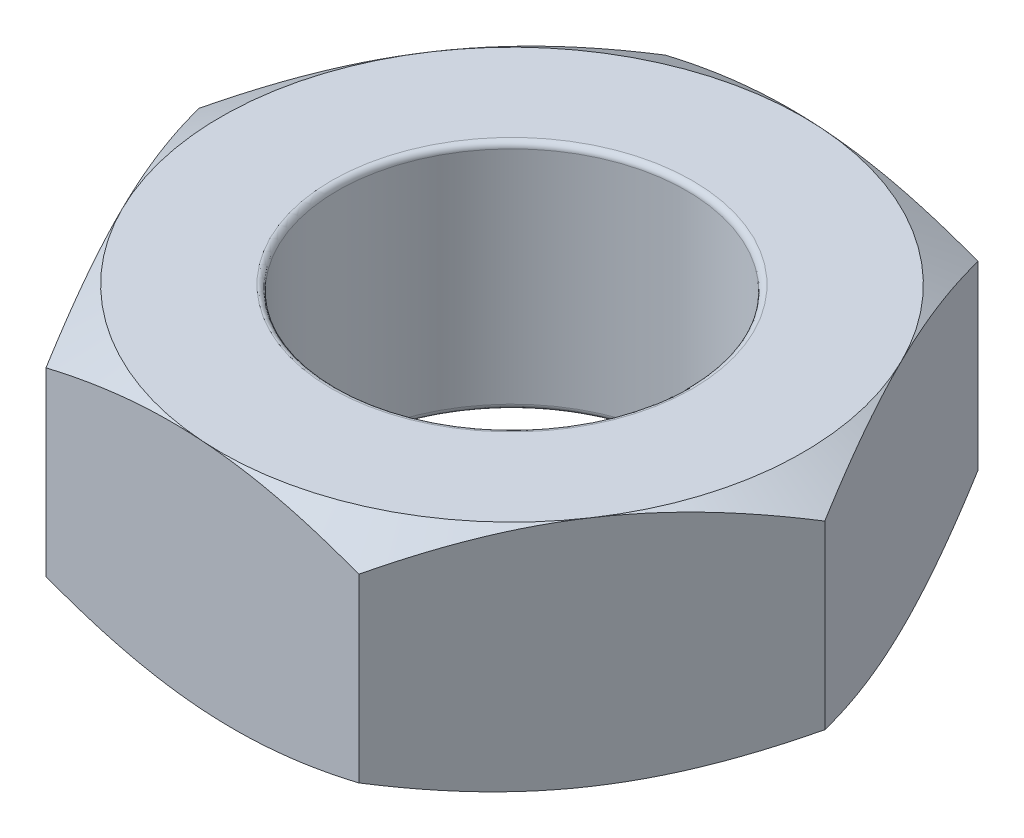
ISO-10303-21;
HEADER;
FILE_DESCRIPTION(('STEP AP214'),'2;1');
FILE_NAME('part.step','',(''),(''),'','','');
FILE_SCHEMA(('AUTOMOTIVE_DESIGN { 1 0 10303 214 1 1 1 1 }'));
ENDSEC;
DATA;
#1=APPLICATION_CONTEXT('core data for automotive mechanical design processes');
#2=APPLICATION_PROTOCOL_DEFINITION('international standard','automotive_design',2000,#1);
#3=PRODUCT_CONTEXT('',#1,'mechanical');
#4=PRODUCT('Part','Part','',(#3));
#5=PRODUCT_RELATED_PRODUCT_CATEGORY('part','',(#4));
#6=PRODUCT_DEFINITION_FORMATION('','',#4);
#7=PRODUCT_DEFINITION_CONTEXT('part definition',#1,'design');
#8=PRODUCT_DEFINITION('design','',#6,#7);
#9=PRODUCT_DEFINITION_SHAPE('','',#8);
#10=(LENGTH_UNIT() NAMED_UNIT(*) SI_UNIT(.MILLI.,.METRE.));
#11=(NAMED_UNIT(*) PLANE_ANGLE_UNIT() SI_UNIT($,.RADIAN.));
#12=(NAMED_UNIT(*) SI_UNIT($,.STERADIAN.) SOLID_ANGLE_UNIT());
#13=UNCERTAINTY_MEASURE_WITH_UNIT(LENGTH_MEASURE(1.E-05),#10,'distance_accuracy_value','');
#14=(GEOMETRIC_REPRESENTATION_CONTEXT(3) GLOBAL_UNCERTAINTY_ASSIGNED_CONTEXT((#13)) GLOBAL_UNIT_ASSIGNED_CONTEXT((#10,
#11,#12)) REPRESENTATION_CONTEXT('',''));
#15=CARTESIAN_POINT('',(0.,0.,0.));
#16=DIRECTION('',(0.,0.,1.));
#17=DIRECTION('',(1.,0.,0.));
#18=AXIS2_PLACEMENT_3D('',#15,#16,#17);
#19=CARTESIAN_POINT('',(-1.27361431394222,2.,-2.59060608982817));
#20=DIRECTION('',(0.830790431180641,0.,0.556585356848961));
#21=DIRECTION('',(0.556585356848961,0.,-0.830790431180641));
#22=AXIS2_PLACEMENT_3D('',#19,#20,#21);
#23=PLANE('',#22);
#24=CARTESIAN_POINT('',(-2.8804718313128,0.223360492131222,-0.192120694416632));
#25=CARTESIAN_POINT('',(-2.80986380166012,0.186724215651782,-0.297514188295199));
#26=CARTESIAN_POINT('',(-2.73864628949333,0.153404567842738,-0.403817429860216));
#27=CARTESIAN_POINT('',(-2.59497799726085,0.0952441224797167,-0.618264757627765));
#28=CARTESIAN_POINT('',(-2.5225246639532,0.0704239011021496,-0.726412654942053));
#29=CARTESIAN_POINT('',(-2.3785159430858,0.0317866995737146,-0.941368125528867));
#30=CARTESIAN_POINT('',(-2.30698271611449,0.0177125838658962,-1.04814262066774));
#31=CARTESIAN_POINT('',(-2.16357958453336,0.000909436624432206,-1.26219415481773));
#32=CARTESIAN_POINT('',(-2.09171020133633,-0.0018335076939088,-1.36947041553896));
#33=CARTESIAN_POINT('',(-1.95741230832504,0.00386541673552177,-1.56993096138077));
#34=CARTESIAN_POINT('',(-1.89496371922326,0.0109080040113135,-1.66314521796885));
#35=CARTESIAN_POINT('',(-1.77047340324417,0.033231156164161,-1.84896642583464));
#36=CARTESIAN_POINT('',(-1.70843210712207,0.0485193504936714,-1.94157273414302));
#37=CARTESIAN_POINT('',(-1.58368500749084,0.0867395522640062,-2.12777723164884));
#38=CARTESIAN_POINT('',(-1.52099499691787,0.109833612928976,-2.22135184742655));
#39=CARTESIAN_POINT('',(-1.3965501128978,0.162248393929256,-2.40710524100947));
#40=CARTESIAN_POINT('',(-1.33479364448095,0.191556794425373,-2.49928639955574));
#41=CARTESIAN_POINT('',(-1.2734803245904,0.223360492131222,-2.59080608982817));
#42=B_SPLINE_CURVE_WITH_KNOTS('',3,(#24,#25,#26,#27,#28,#29,#30,#31,#32,#33,#34,#35,#36,#37,#38,
#39,#40,#41),.UNSPECIFIED.,.F.,.F.,(4,2,2,2,2,2,2,2,4),(0.,0.396286498049262,0.793525689892849,
1.18093283486657,1.56786416697508,1.90480431794579,2.24205676733797,2.58679114709091,
2.93084838126731),.UNSPECIFIED.);
#43=CARTESIAN_POINT('',(-2.88033784196098,0.223290993692602,-0.192320694416631));
#44=VERTEX_POINT('',#43);
#45=CARTESIAN_POINT('',(-2.0769760779516,0.,-1.3914633921224));
#46=VERTEX_POINT('',#45);
#47=EDGE_CURVE('E71',#44,#46,#42,.T.);
#48=ORIENTED_EDGE('',*,*,#47,.F.);
#49=DIRECTION('',(0.,-1.,0.));
#50=VECTOR('',#49,1.);
#51=CARTESIAN_POINT('',(-2.88033784196098,2.,-0.192320694416632));
#52=LINE('',#51,#50);
#53=CARTESIAN_POINT('',(-2.88033784196098,1.7767090063074,-0.192320694416632));
#54=VERTEX_POINT('',#53);
#55=EDGE_CURVE('E305',#54,#44,#52,.T.);
#56=ORIENTED_EDGE('',*,*,#55,.F.);
#57=CARTESIAN_POINT('',(-1.2734803245904,1.77663950786878,-2.59080608982817));
#58=CARTESIAN_POINT('',(-1.34408835424308,1.81327578434822,-2.48541259594961));
#59=CARTESIAN_POINT('',(-1.41530586640988,1.84659543215726,-2.37910935438459));
#60=CARTESIAN_POINT('',(-1.55897415864236,1.90475587752028,-2.16466202661704));
#61=CARTESIAN_POINT('',(-1.63142749195001,1.92957609889785,-2.05651412930275));
#62=CARTESIAN_POINT('',(-1.77543621281741,1.96821330042629,-1.84155865871594));
#63=CARTESIAN_POINT('',(-1.84696943978871,1.9822874161341,-1.73478416357707));
#64=CARTESIAN_POINT('',(-1.99037257136985,1.99909056337557,-1.52073262942707));
#65=CARTESIAN_POINT('',(-2.06224195456687,2.00183350769391,-1.41345636870585));
#66=CARTESIAN_POINT('',(-2.19653984757816,1.99613458326448,-1.21299582286404));
#67=CARTESIAN_POINT('',(-2.25898843667994,1.98909199598869,-1.11978156627595));
#68=CARTESIAN_POINT('',(-2.38347875265903,1.96676884383584,-0.933960358410169));
#69=CARTESIAN_POINT('',(-2.44552004878113,1.95148064950633,-0.841354050101789));
#70=CARTESIAN_POINT('',(-2.57026714841236,1.91326044773599,-0.655149552595963));
#71=CARTESIAN_POINT('',(-2.63295715898533,1.89016638707102,-0.56157493681826));
#72=CARTESIAN_POINT('',(-2.7574020430054,1.83775160607074,-0.375821543235331));
#73=CARTESIAN_POINT('',(-2.81915851142225,1.80844320557463,-0.28364038468906));
#74=CARTESIAN_POINT('',(-2.8804718313128,1.77663950786878,-0.192120694416631));
#75=B_SPLINE_CURVE_WITH_KNOTS('',3,(#57,#58,#59,#60,#61,#62,#63,#64,#65,#66,#67,#68,#69,#70,#71,
#72,#73,#74),.UNSPECIFIED.,.F.,.F.,(4,2,2,2,2,2,2,2,4),(0.,0.396286498049262,0.79352568989285,
1.18093283486657,1.56786416697508,1.90480431794579,2.24205676733797,2.58679114709091,
2.93084838126731),.UNSPECIFIED.);
#76=CARTESIAN_POINT('',(-2.0769760779516,2.,-1.3914633921224));
#77=VERTEX_POINT('',#76);
#78=EDGE_CURVE('E285',#77,#54,#75,.T.);
#79=ORIENTED_EDGE('',*,*,#78,.F.);
#80=CARTESIAN_POINT('',(-1.27361431394222,1.7767090063074,-2.59060608982817));
#81=VERTEX_POINT('',#80);
#82=EDGE_CURVE('E291',#81,#77,#75,.T.);
#83=ORIENTED_EDGE('',*,*,#82,.F.);
#84=DIRECTION('',(0.,-1.,0.));
#85=VECTOR('',#84,1.);
#86=CARTESIAN_POINT('',(-1.27361431394222,2.,-2.59060608982817));
#87=LINE('',#86,#85);
#88=CARTESIAN_POINT('',(-1.27361431394222,0.223290993692602,-2.59060608982817));
#89=VERTEX_POINT('',#88);
#90=EDGE_CURVE('E293',#81,#89,#87,.T.);
#91=ORIENTED_EDGE('',*,*,#90,.T.);
#92=EDGE_CURVE('E186',#46,#89,#42,.T.);
#93=ORIENTED_EDGE('',*,*,#92,.F.);
#94=EDGE_LOOP('',(#48,#56,#79,#83,#91,#93));
#95=FACE_BOUND('',#94,.T.);
#96=ADVANCED_FACE('F48',(#95),#23,.F.);
#97=CARTESIAN_POINT('',(-2.88033784196098,2.,-0.192320694416632));
#98=DIRECTION('',(0.897412273995948,0.,-0.441192940198982));
#99=DIRECTION('',(-0.441192940198982,0.,-0.897412273995948));
#100=AXIS2_PLACEMENT_3D('',#97,#98,#99);
#101=PLANE('',#100);
#102=CARTESIAN_POINT('',(-1.60662520243241,0.223355332426769,2.39848539541154));
#103=CARTESIAN_POINT('',(-1.66259449762223,0.186719479683932,2.28464057176682));
#104=CARTESIAN_POINT('',(-1.71904691530838,0.153400281956862,2.1698130486758));
#105=CARTESIAN_POINT('',(-1.83292932178774,0.0952407707380594,1.93816956562123));
#106=CARTESIAN_POINT('',(-1.89036133439422,0.0704210328353752,1.82134948910301));
#107=CARTESIAN_POINT('',(-2.00451358363305,0.0317847871021549,1.5891571300753));
#108=CARTESIAN_POINT('',(-2.06121625464183,0.0177111466306705,1.47382057707271));
#109=CARTESIAN_POINT('',(-2.17488845729822,0.000908917936975301,1.24260466090236));
#110=CARTESIAN_POINT('',(-2.23185757566622,-0.00183358268119343,1.12672613836953));
#111=CARTESIAN_POINT('',(-2.33831122165894,0.00386604309677712,0.910193189128776));
#112=CARTESIAN_POINT('',(-2.38781166979709,0.0109087163075833,0.809506379164312));
#113=CARTESIAN_POINT('',(-2.48649006475729,0.0332316359780781,0.608788745796097));
#114=CARTESIAN_POINT('',(-2.53566767016656,0.0485195109662276,0.508758616845936));
#115=CARTESIAN_POINT('',(-2.63454958810946,0.0867387158063652,0.307627005813809));
#116=CARTESIAN_POINT('',(-2.68424138296334,0.109832086051889,0.20655098542543));
#117=CARTESIAN_POINT('',(-2.78288375062307,0.162245223864608,0.00590663369592742));
#118=CARTESIAN_POINT('',(-2.83183558758333,0.19155267289636,-0.0936642690093186));
#119=CARTESIAN_POINT('',(-2.88043616754733,0.223355332426769,-0.192520694416632));
#120=B_SPLINE_CURVE_WITH_KNOTS('',3,(#102,#103,#104,#105,#106,#107,#108,#109,#110,#111,#112,
#113,#114,#115,#116,#117,#118,#119),.UNSPECIFIED.,.F.,.F.,(4,2,2,2,2,2,2,2,4),(0.,
0.396285274277618,0.793523208836641,1.1809292469671,1.56785948558832,1.90479172780143,
2.24203623860918,2.58676225962568,2.93081119436377),.UNSPECIFIED.);
#121=CARTESIAN_POINT('',(-1.60672352801876,0.223290993692602,2.39828539541154));
#122=VERTEX_POINT('',#121);
#123=CARTESIAN_POINT('',(-2.24353068498987,0.,1.10298235049745));
#124=VERTEX_POINT('',#123);
#125=EDGE_CURVE('E176',#122,#124,#120,.T.);
#126=ORIENTED_EDGE('',*,*,#125,.F.);
#127=DIRECTION('',(0.,-1.,0.));
#128=VECTOR('',#127,1.);
#129=CARTESIAN_POINT('',(-1.60672352801876,2.,2.39828539541154));
#130=LINE('',#129,#128);
#131=CARTESIAN_POINT('',(-1.60672352801876,1.7767090063074,2.39828539541154));
#132=VERTEX_POINT('',#131);
#133=EDGE_CURVE('E302',#132,#122,#130,.T.);
#134=ORIENTED_EDGE('',*,*,#133,.F.);
#135=CARTESIAN_POINT('',(-2.88043616754733,1.77664466757323,-0.192520694416632));
#136=CARTESIAN_POINT('',(-2.82446687235751,1.81328052031607,-0.0786758707719152));
#137=CARTESIAN_POINT('',(-2.76801445467136,1.84659971804314,0.0361516523191128));
#138=CARTESIAN_POINT('',(-2.654132048192,1.90475922926194,0.267795135373675));
#139=CARTESIAN_POINT('',(-2.59670003558552,1.92957896716462,0.384615211891894));
#140=CARTESIAN_POINT('',(-2.48254778634668,1.96821521289784,0.616807570919613));
#141=CARTESIAN_POINT('',(-2.42584511533791,1.98228885336933,0.732144123922201));
#142=CARTESIAN_POINT('',(-2.31217291268152,1.99909108206302,0.963360040092551));
#143=CARTESIAN_POINT('',(-2.25520379431352,2.00183358268119,1.07923856262538));
#144=CARTESIAN_POINT('',(-2.1487501483208,1.99613395690322,1.29577151186613));
#145=CARTESIAN_POINT('',(-2.09924970018265,1.98909128369242,1.3964583218306));
#146=CARTESIAN_POINT('',(-2.00057130522245,1.96676836402192,1.59717595519881));
#147=CARTESIAN_POINT('',(-1.95139369981318,1.95148048903377,1.69720608414897));
#148=CARTESIAN_POINT('',(-1.85251178187028,1.91326128419364,1.8983376951811));
#149=CARTESIAN_POINT('',(-1.8028199870164,1.89016791394811,1.99941371556948));
#150=CARTESIAN_POINT('',(-1.70417761935667,1.83775477613539,2.20005806729898));
#151=CARTESIAN_POINT('',(-1.65522578239641,1.80844732710364,2.29962897000423));
#152=CARTESIAN_POINT('',(-1.60662520243241,1.77664466757323,2.39848539541154));
#153=B_SPLINE_CURVE_WITH_KNOTS('',3,(#135,#136,#137,#138,#139,#140,#141,#142,#143,#144,#145,
#146,#147,#148,#149,#150,#151,#152),.UNSPECIFIED.,.F.,.F.,(4,2,2,2,2,2,2,2,4),(0.,
0.396285274277618,0.793523208836641,1.1809292469671,1.56785948558832,1.90479172780143,
2.24203623860918,2.58676225962568,2.93081119436377),.UNSPECIFIED.);
#154=CARTESIAN_POINT('',(-2.24353068498987,2.,1.10298235049745));
#155=VERTEX_POINT('',#154);
#156=EDGE_CURVE('E264',#155,#132,#153,.T.);
#157=ORIENTED_EDGE('',*,*,#156,.F.);
#158=EDGE_CURVE('E292',#54,#155,#153,.T.);
#159=ORIENTED_EDGE('',*,*,#158,.F.);
#160=ORIENTED_EDGE('',*,*,#55,.T.);
#161=EDGE_CURVE('E150',#124,#44,#120,.T.);
#162=ORIENTED_EDGE('',*,*,#161,.F.);
#163=EDGE_LOOP('',(#126,#134,#157,#159,#160,#162));
#164=FACE_BOUND('',#163,.T.);
#165=ADVANCED_FACE('F273',(#164),#101,.F.);
#166=CARTESIAN_POINT('',(-1.60672352801876,2.,2.39828539541154));
#167=DIRECTION('',(0.0666218428153073,0.,-0.997778297047943));
#168=DIRECTION('',(-0.997778297047943,0.,-0.0666218428153073));
#169=AXIS2_PLACEMENT_3D('',#166,#167,#168);
#170=PLANE('',#169);
#171=CARTESIAN_POINT('',(1.27381431394222,0.223348860288484,2.59061944386544));
#172=CARTESIAN_POINT('',(1.14723753449179,0.186713539071293,2.5821678887158));
#173=CARTESIAN_POINT('',(1.0195681535317,0.153394905917019,2.57364338035977));
#174=CARTESIAN_POINT('',(0.762018606557151,0.0952365664672077,2.55644674911768));
#175=CARTESIAN_POINT('',(0.63213386383723,0.0704174350239425,2.54777432064415));
#176=CARTESIAN_POINT('',(0.373974076261845,0.0317823882166104,2.53053694352343));
#177=CARTESIAN_POINT('',(0.24573875521575,0.017709343869416,2.52197464724241));
#178=CARTESIAN_POINT('',(-0.0113353583428609,0.000908267376840826,2.50480976077809));
#179=CARTESIAN_POINT('',(-0.140173216297431,-0.00183367667688157,2.49620723299541));
#180=CARTESIAN_POINT('',(-0.380919293570337,0.00386682882951836,2.48013257255638));
#181=CARTESIAN_POINT('',(-0.492863529514754,0.010909609818012,2.4726580350632));
#182=CARTESIAN_POINT('',(-0.716022676381481,0.0332322378484759,2.45775765724446));
#183=CARTESIAN_POINT('',(-0.827236815288971,0.0485197122599824,2.45033186846648));
#184=CARTESIAN_POINT('',(-1.05085617143185,0.086737666581051,2.43540076238861));
#185=CARTESIAN_POINT('',(-1.16323308228277,0.10983017079073,2.4278973351113));
#186=CARTESIAN_POINT('',(-1.38631071092521,0.162241247453206,2.41300240027959));
#187=CARTESIAN_POINT('',(-1.49701428725516,0.191547503005819,2.40561070186004));
#188=CARTESIAN_POINT('',(-1.60692352801876,0.223348860288483,2.39827204137427));
#189=B_SPLINE_CURVE_WITH_KNOTS('',3,(#171,#172,#173,#174,#175,#176,#177,#178,#179,#180,#181,
#182,#183,#184,#185,#186,#187,#188),.UNSPECIFIED.,.F.,.F.,(4,2,2,2,2,2,2,2,4),(0.,
0.396283739223727,0.793520096691492,1.18092474643986,1.56785361343206,1.90477593507899,
2.24201048790883,2.58672602393769,2.93076454806571),.UNSPECIFIED.);
#190=CARTESIAN_POINT('',(1.27361431394222,0.223290993692602,2.59060608982817));
#191=VERTEX_POINT('',#190);
#192=CARTESIAN_POINT('',(-0.166554607038268,0.,2.49444574261986));
#193=VERTEX_POINT('',#192);
#194=EDGE_CURVE('E159',#191,#193,#189,.T.);
#195=ORIENTED_EDGE('',*,*,#194,.F.);
#196=DIRECTION('',(0.,-1.,0.));
#197=VECTOR('',#196,1.);
#198=CARTESIAN_POINT('',(1.27361431394222,2.,2.59060608982817));
#199=LINE('',#198,#197);
#200=CARTESIAN_POINT('',(1.27361431394222,1.7767090063074,2.59060608982817));
#201=VERTEX_POINT('',#200);
#202=EDGE_CURVE('E174',#201,#191,#199,.T.);
#203=ORIENTED_EDGE('',*,*,#202,.F.);
#204=CARTESIAN_POINT('',(-1.60692352801876,1.77665113971152,2.39827204137427));
#205=CARTESIAN_POINT('',(-1.48034674856832,1.81328646092871,2.40672359652391));
#206=CARTESIAN_POINT('',(-1.35267736760824,1.84660509408298,2.41524810487994));
#207=CARTESIAN_POINT('',(-1.09512782063369,1.90476343353279,2.43244473612203));
#208=CARTESIAN_POINT('',(-0.965243077913766,1.92958256497606,2.44111716459557));
#209=CARTESIAN_POINT('',(-0.707083290338381,1.96821761178339,2.45835454171628));
#210=CARTESIAN_POINT('',(-0.578847969292286,1.98229065613058,2.46691683799731));
#211=CARTESIAN_POINT('',(-0.321773855733675,1.99909173262316,2.48408172446162));
#212=CARTESIAN_POINT('',(-0.192935997779105,2.00183367667688,2.49268425224431));
#213=CARTESIAN_POINT('',(0.0478100794938011,1.99613317117048,2.50875891268333));
#214=CARTESIAN_POINT('',(0.159754315438218,1.98909039018199,2.51623345017652));
#215=CARTESIAN_POINT('',(0.382913462304945,1.96676776215152,2.53113382799526));
#216=CARTESIAN_POINT('',(0.494127601212436,1.95148028774002,2.53855961677324));
#217=CARTESIAN_POINT('',(0.717746957355318,1.91326233341895,2.5534907228511));
#218=CARTESIAN_POINT('',(0.830123868206239,1.89016982920927,2.56099415012841));
#219=CARTESIAN_POINT('',(1.05320149684867,1.83775875254679,2.57588908496013));
#220=CARTESIAN_POINT('',(1.16390507317863,1.80845249699418,2.58328078337967));
#221=CARTESIAN_POINT('',(1.27381431394222,1.77665113971152,2.59061944386544));
#222=B_SPLINE_CURVE_WITH_KNOTS('',3,(#204,#205,#206,#207,#208,#209,#210,#211,#212,#213,#214,
#215,#216,#217,#218,#219,#220,#221),.UNSPECIFIED.,.F.,.F.,(4,2,2,2,2,2,2,2,4),(0.,
0.396283739223727,0.793520096691491,1.18092474643986,1.56785361343206,1.90477593507899,
2.24201048790883,2.58672602393769,2.93076454806571),.UNSPECIFIED.);
#223=CARTESIAN_POINT('',(-0.166554607038268,2.,2.49444574261986));
#224=VERTEX_POINT('',#223);
#225=EDGE_CURVE('E257',#224,#201,#222,.T.);
#226=ORIENTED_EDGE('',*,*,#225,.F.);
#227=EDGE_CURVE('E263',#132,#224,#222,.T.);
#228=ORIENTED_EDGE('',*,*,#227,.F.);
#229=ORIENTED_EDGE('',*,*,#133,.T.);
#230=EDGE_CURVE('E175',#193,#122,#189,.T.);
#231=ORIENTED_EDGE('',*,*,#230,.F.);
#232=EDGE_LOOP('',(#195,#203,#226,#228,#229,#231));
#233=FACE_BOUND('',#232,.T.);
#234=ADVANCED_FACE('F270',(#233),#170,.F.);
#235=CARTESIAN_POINT('',(1.27361431394222,2.,2.59060608982817));
#236=DIRECTION('',(-0.830790431180641,0.,-0.556585356848961));
#237=DIRECTION('',(-0.556585356848961,0.,0.830790431180641));
#238=AXIS2_PLACEMENT_3D('',#235,#236,#237);
#239=PLANE('',#238);
#240=CARTESIAN_POINT('',(2.8804718313128,0.223360492131222,0.192120694416632));
#241=CARTESIAN_POINT('',(2.80986380166012,0.186724215651782,0.2975141882952));
#242=CARTESIAN_POINT('',(2.73864628949333,0.153404567842739,0.403817429860216));
#243=CARTESIAN_POINT('',(2.59497799726085,0.0952441224797171,0.618264757627765));
#244=CARTESIAN_POINT('',(2.5225246639532,0.0704239011021498,0.726412654942053));
#245=CARTESIAN_POINT('',(2.3785159430858,0.0317866995737149,0.941368125528867));
#246=CARTESIAN_POINT('',(2.30698271611449,0.0177125838658965,1.04814262066774));
#247=CARTESIAN_POINT('',(2.16357958453336,0.000909436624432542,1.26219415481773));
#248=CARTESIAN_POINT('',(2.09171020133633,-0.00183350769390847,1.36947041553896));
#249=CARTESIAN_POINT('',(1.95741230832504,0.00386541673552218,1.56993096138077));
#250=CARTESIAN_POINT('',(1.89496371922326,0.010908004011314,1.66314521796885));
#251=CARTESIAN_POINT('',(1.77047340324417,0.0332311561641616,1.84896642583464));
#252=CARTESIAN_POINT('',(1.70843210712207,0.0485193504936719,1.94157273414302));
#253=CARTESIAN_POINT('',(1.58368500749085,0.0867395522640067,2.12777723164884));
#254=CARTESIAN_POINT('',(1.52099499691787,0.109833612928976,2.22135184742655));
#255=CARTESIAN_POINT('',(1.3965501128978,0.162248393929256,2.40710524100948));
#256=CARTESIAN_POINT('',(1.33479364448096,0.191556794425373,2.49928639955575));
#257=CARTESIAN_POINT('',(1.27348032459041,0.223360492131222,2.59080608982817));
#258=B_SPLINE_CURVE_WITH_KNOTS('',3,(#240,#241,#242,#243,#244,#245,#246,#247,#248,#249,#250,
#251,#252,#253,#254,#255,#256,#257),.UNSPECIFIED.,.F.,.F.,(4,2,2,2,2,2,2,2,4),(0.,
0.396286498049262,0.793525689892849,1.18093283486657,1.56786416697508,1.90480431794579,
2.24205676733797,2.58679114709091,2.93084838126731),.UNSPECIFIED.);
#259=CARTESIAN_POINT('',(2.88033784196098,0.223290993692602,0.192320694416632));
#260=VERTEX_POINT('',#259);
#261=CARTESIAN_POINT('',(2.0769760779516,0.,1.3914633921224));
#262=VERTEX_POINT('',#261);
#263=EDGE_CURVE('E138',#260,#262,#258,.T.);
#264=ORIENTED_EDGE('',*,*,#263,.F.);
#265=DIRECTION('',(0.,-1.,0.));
#266=VECTOR('',#265,1.);
#267=CARTESIAN_POINT('',(2.88033784196098,2.,0.192320694416632));
#268=LINE('',#267,#266);
#269=CARTESIAN_POINT('',(2.88033784196098,1.7767090063074,0.192320694416632));
#270=VERTEX_POINT('',#269);
#271=EDGE_CURVE('E299',#270,#260,#268,.T.);
#272=ORIENTED_EDGE('',*,*,#271,.F.);
#273=CARTESIAN_POINT('',(1.27348032459041,1.77663950786878,2.59080608982817));
#274=CARTESIAN_POINT('',(1.34408835424308,1.81327578434822,2.48541259594961));
#275=CARTESIAN_POINT('',(1.41530586640988,1.84659543215726,2.37910935438459));
#276=CARTESIAN_POINT('',(1.55897415864236,1.90475587752028,2.16466202661704));
#277=CARTESIAN_POINT('',(1.63142749195001,1.92957609889785,2.05651412930275));
#278=CARTESIAN_POINT('',(1.77543621281741,1.96821330042629,1.84155865871594));
#279=CARTESIAN_POINT('',(1.84696943978872,1.9822874161341,1.73478416357707));
#280=CARTESIAN_POINT('',(1.99037257136985,1.99909056337557,1.52073262942707));
#281=CARTESIAN_POINT('',(2.06224195456687,2.00183350769391,1.41345636870585));
#282=CARTESIAN_POINT('',(2.19653984757816,1.99613458326448,1.21299582286404));
#283=CARTESIAN_POINT('',(2.25898843667994,1.98909199598869,1.11978156627595));
#284=CARTESIAN_POINT('',(2.38347875265903,1.96676884383584,0.933960358410169));
#285=CARTESIAN_POINT('',(2.44552004878113,1.95148064950633,0.841354050101789));
#286=CARTESIAN_POINT('',(2.57026714841236,1.91326044773599,0.655149552595963));
#287=CARTESIAN_POINT('',(2.63295715898533,1.89016638707102,0.561574936818261));
#288=CARTESIAN_POINT('',(2.7574020430054,1.83775160607074,0.375821543235332));
#289=CARTESIAN_POINT('',(2.81915851142225,1.80844320557463,0.283640384689061));
#290=CARTESIAN_POINT('',(2.8804718313128,1.77663950786878,0.192120694416632));
#291=B_SPLINE_CURVE_WITH_KNOTS('',3,(#273,#274,#275,#276,#277,#278,#279,#280,#281,#282,#283,
#284,#285,#286,#287,#288,#289,#290),.UNSPECIFIED.,.F.,.F.,(4,2,2,2,2,2,2,2,4),(0.,
0.396286498049262,0.79352568989285,1.18093283486657,1.56786416697508,1.90480431794579,
2.24205676733797,2.58679114709091,2.9308483812673),.UNSPECIFIED.);
#292=CARTESIAN_POINT('',(2.0769760779516,2.,1.3914633921224));
#293=VERTEX_POINT('',#292);
#294=EDGE_CURVE('E250',#293,#270,#291,.T.);
#295=ORIENTED_EDGE('',*,*,#294,.F.);
#296=EDGE_CURVE('E256',#201,#293,#291,.T.);
#297=ORIENTED_EDGE('',*,*,#296,.F.);
#298=ORIENTED_EDGE('',*,*,#202,.T.);
#299=EDGE_CURVE('E152',#262,#191,#258,.T.);
#300=ORIENTED_EDGE('',*,*,#299,.F.);
#301=EDGE_LOOP('',(#264,#272,#295,#297,#298,#300));
#302=FACE_BOUND('',#301,.T.);
#303=ADVANCED_FACE('F171',(#302),#239,.F.);
#304=CARTESIAN_POINT('',(2.88033784196098,2.,0.192320694416632));
#305=DIRECTION('',(-0.897412273995948,0.,0.441192940198982));
#306=DIRECTION('',(0.441192940198982,0.,0.897412273995948));
#307=AXIS2_PLACEMENT_3D('',#304,#305,#306);
#308=PLANE('',#307);
#309=CARTESIAN_POINT('',(1.60662520243241,0.223355332426769,-2.39848539541154));
#310=CARTESIAN_POINT('',(1.66259449762223,0.186719479683932,-2.28464057176682));
#311=CARTESIAN_POINT('',(1.71904691530838,0.153400281956863,-2.1698130486758));
#312=CARTESIAN_POINT('',(1.83292932178774,0.0952407707380595,-1.93816956562123));
#313=CARTESIAN_POINT('',(1.89036133439422,0.0704210328353753,-1.82134948910301));
#314=CARTESIAN_POINT('',(2.00451358363306,0.0317847871021549,-1.5891571300753));
#315=CARTESIAN_POINT('',(2.06121625464183,0.0177111466306706,-1.47382057707271));
#316=CARTESIAN_POINT('',(2.17488845729822,0.00090891793697549,-1.24260466090236));
#317=CARTESIAN_POINT('',(2.23185757566622,-0.0018335826811931,-1.12672613836953));
#318=CARTESIAN_POINT('',(2.33831122165894,0.00386604309677754,-0.910193189128775));
#319=CARTESIAN_POINT('',(2.38781166979709,0.0109087163075837,-0.809506379164312));
#320=CARTESIAN_POINT('',(2.48649006475729,0.0332316359780785,-0.608788745796096));
#321=CARTESIAN_POINT('',(2.53566767016656,0.048519510966228,-0.508758616845935));
#322=CARTESIAN_POINT('',(2.63454958810946,0.0867387158063656,-0.307627005813809));
#323=CARTESIAN_POINT('',(2.68424138296334,0.109832086051889,-0.206550985425429));
#324=CARTESIAN_POINT('',(2.78288375062307,0.162245223864609,-0.00590663369592686));
#325=CARTESIAN_POINT('',(2.83183558758333,0.191552672896361,0.093664269009319));
#326=CARTESIAN_POINT('',(2.88043616754733,0.223355332426769,0.192520694416632));
#327=B_SPLINE_CURVE_WITH_KNOTS('',3,(#309,#310,#311,#312,#313,#314,#315,#316,#317,#318,#319,
#320,#321,#322,#323,#324,#325,#326),.UNSPECIFIED.,.F.,.F.,(4,2,2,2,2,2,2,2,4),(0.,
0.396285274277619,0.793523208836642,1.1809292469671,1.56785948558832,1.90479172780143,
2.24203623860918,2.58676225962568,2.93081119436377),.UNSPECIFIED.);
#328=CARTESIAN_POINT('',(1.60672352801876,0.223290993692602,-2.39828539541154));
#329=VERTEX_POINT('',#328);
#330=CARTESIAN_POINT('',(2.24353068498987,0.,-1.10298235049745));
#331=VERTEX_POINT('',#330);
#332=EDGE_CURVE('E63',#329,#331,#327,.T.);
#333=ORIENTED_EDGE('',*,*,#332,.F.);
#334=DIRECTION('',(0.,-1.,0.));
#335=VECTOR('',#334,1.);
#336=CARTESIAN_POINT('',(1.60672352801876,2.,-2.39828539541154));
#337=LINE('',#336,#335);
#338=CARTESIAN_POINT('',(1.60672352801876,1.7767090063074,-2.39828539541154));
#339=VERTEX_POINT('',#338);
#340=EDGE_CURVE('E296',#339,#329,#337,.T.);
#341=ORIENTED_EDGE('',*,*,#340,.F.);
#342=CARTESIAN_POINT('',(2.88043616754733,1.77664466757323,0.192520694416632));
#343=CARTESIAN_POINT('',(2.82446687235751,1.81328052031607,0.0786758707719153));
#344=CARTESIAN_POINT('',(2.76801445467136,1.84659971804314,-0.0361516523191126));
#345=CARTESIAN_POINT('',(2.654132048192,1.90475922926194,-0.267795135373675));
#346=CARTESIAN_POINT('',(2.59670003558552,1.92957896716462,-0.384615211891894));
#347=CARTESIAN_POINT('',(2.48254778634669,1.96821521289784,-0.616807570919613));
#348=CARTESIAN_POINT('',(2.42584511533791,1.98228885336933,-0.732144123922201));
#349=CARTESIAN_POINT('',(2.31217291268152,1.99909108206302,-0.963360040092552));
#350=CARTESIAN_POINT('',(2.25520379431352,2.00183358268119,-1.07923856262538));
#351=CARTESIAN_POINT('',(2.1487501483208,1.99613395690322,-1.29577151186613));
#352=CARTESIAN_POINT('',(2.09924970018265,1.98909128369242,-1.3964583218306));
#353=CARTESIAN_POINT('',(2.00057130522245,1.96676836402192,-1.59717595519881));
#354=CARTESIAN_POINT('',(1.95139369981318,1.95148048903377,-1.69720608414897));
#355=CARTESIAN_POINT('',(1.85251178187028,1.91326128419363,-1.8983376951811));
#356=CARTESIAN_POINT('',(1.8028199870164,1.89016791394811,-1.99941371556948));
#357=CARTESIAN_POINT('',(1.70417761935668,1.83775477613539,-2.20005806729898));
#358=CARTESIAN_POINT('',(1.65522578239641,1.80844732710364,-2.29962897000423));
#359=CARTESIAN_POINT('',(1.60662520243241,1.77664466757323,-2.39848539541154));
#360=B_SPLINE_CURVE_WITH_KNOTS('',3,(#342,#343,#344,#345,#346,#347,#348,#349,#350,#351,#352,
#353,#354,#355,#356,#357,#358,#359),.UNSPECIFIED.,.F.,.F.,(4,2,2,2,2,2,2,2,4),(0.,
0.396285274277618,0.793523208836642,1.1809292469671,1.56785948558832,1.90479172780143,
2.24203623860918,2.58676225962568,2.93081119436377),.UNSPECIFIED.);
#361=CARTESIAN_POINT('',(2.24353068498987,2.,-1.10298235049746));
#362=VERTEX_POINT('',#361);
#363=EDGE_CURVE('E242',#362,#339,#360,.T.);
#364=ORIENTED_EDGE('',*,*,#363,.F.);
#365=EDGE_CURVE('E248',#270,#362,#360,.T.);
#366=ORIENTED_EDGE('',*,*,#365,.F.);
#367=ORIENTED_EDGE('',*,*,#271,.T.);
#368=EDGE_CURVE('E145',#331,#260,#327,.T.);
#369=ORIENTED_EDGE('',*,*,#368,.F.);
#370=EDGE_LOOP('',(#333,#341,#364,#366,#367,#369));
#371=FACE_BOUND('',#370,.T.);
#372=ADVANCED_FACE('F233',(#371),#308,.F.);
#373=CARTESIAN_POINT('',(1.60672352801876,2.,-2.39828539541154));
#374=DIRECTION('',(-0.0666218428153072,0.,0.997778297047943));
#375=DIRECTION('',(0.997778297047943,0.,0.0666218428153072));
#376=AXIS2_PLACEMENT_3D('',#373,#374,#375);
#377=PLANE('',#376);
#378=CARTESIAN_POINT('',(-1.27381431394222,0.223348860288483,-2.59061944386544));
#379=CARTESIAN_POINT('',(-1.14723753449178,0.186713539071293,-2.5821678887158));
#380=CARTESIAN_POINT('',(-1.0195681535317,0.153394905917019,-2.57364338035977));
#381=CARTESIAN_POINT('',(-0.76201860655715,0.0952365664672076,-2.55644674911768));
#382=CARTESIAN_POINT('',(-0.632133863837229,0.0704174350239426,-2.54777432064415));
#383=CARTESIAN_POINT('',(-0.373974076261844,0.0317823882166104,-2.53053694352343));
#384=CARTESIAN_POINT('',(-0.245738755215749,0.0177093438694158,-2.52197464724241));
#385=CARTESIAN_POINT('',(0.0113353583428617,0.000908267376840748,-2.50480976077809));
#386=CARTESIAN_POINT('',(0.140173216297432,-0.00183367667688132,-2.49620723299541));
#387=CARTESIAN_POINT('',(0.380919293570338,0.00386682882951886,-2.48013257255638));
#388=CARTESIAN_POINT('',(0.492863529514755,0.0109096098180125,-2.4726580350632));
#389=CARTESIAN_POINT('',(0.716022676381482,0.0332322378484763,-2.45775765724446));
#390=CARTESIAN_POINT('',(0.827236815288972,0.0485197122599828,-2.45033186846648));
#391=CARTESIAN_POINT('',(1.05085617143185,0.0867376665810515,-2.43540076238861));
#392=CARTESIAN_POINT('',(1.16323308228278,0.10983017079073,-2.4278973351113));
#393=CARTESIAN_POINT('',(1.38631071092521,0.162241247453207,-2.41300240027959));
#394=CARTESIAN_POINT('',(1.49701428725516,0.19154750300582,-2.40561070186004));
#395=CARTESIAN_POINT('',(1.60692352801876,0.223348860288483,-2.39827204137427));
#396=B_SPLINE_CURVE_WITH_KNOTS('',3,(#378,#379,#380,#381,#382,#383,#384,#385,#386,#387,#388,
#389,#390,#391,#392,#393,#394,#395),.UNSPECIFIED.,.F.,.F.,(4,2,2,2,2,2,2,2,4),(0.,
0.396283739223727,0.793520096691491,1.18092474643986,1.56785361343206,1.90477593507899,
2.24201048790883,2.58672602393769,2.93076454806571),.UNSPECIFIED.);
#397=CARTESIAN_POINT('',(0.166554607038268,0.,-2.49444574261986));
#398=VERTEX_POINT('',#397);
#399=EDGE_CURVE('E232',#89,#398,#396,.T.);
#400=ORIENTED_EDGE('',*,*,#399,.F.);
#401=ORIENTED_EDGE('',*,*,#90,.F.);
#402=CARTESIAN_POINT('',(1.60692352801876,1.77665113971152,-2.39827204137427));
#403=CARTESIAN_POINT('',(1.48034674856832,1.81328646092871,-2.40672359652391));
#404=CARTESIAN_POINT('',(1.35267736760824,1.84660509408298,-2.41524810487994));
#405=CARTESIAN_POINT('',(1.09512782063369,1.90476343353279,-2.43244473612203));
#406=CARTESIAN_POINT('',(0.965243077913766,1.92958256497606,-2.44111716459557));
#407=CARTESIAN_POINT('',(0.70708329033838,1.96821761178339,-2.45835454171628));
#408=CARTESIAN_POINT('',(0.578847969292285,1.98229065613058,-2.46691683799731));
#409=CARTESIAN_POINT('',(0.321773855733675,1.99909173262316,-2.48408172446163));
#410=CARTESIAN_POINT('',(0.192935997779104,2.00183367667688,-2.49268425224431));
#411=CARTESIAN_POINT('',(-0.0478100794938012,1.99613317117048,-2.50875891268333));
#412=CARTESIAN_POINT('',(-0.159754315438218,1.98909039018199,-2.51623345017652));
#413=CARTESIAN_POINT('',(-0.382913462304945,1.96676776215152,-2.53113382799526));
#414=CARTESIAN_POINT('',(-0.494127601212435,1.95148028774002,-2.53855961677324));
#415=CARTESIAN_POINT('',(-0.717746957355317,1.91326233341895,-2.5534907228511));
#416=CARTESIAN_POINT('',(-0.830123868206239,1.89016982920927,-2.56099415012841));
#417=CARTESIAN_POINT('',(-1.05320149684867,1.83775875254679,-2.57588908496013));
#418=CARTESIAN_POINT('',(-1.16390507317863,1.80845249699418,-2.58328078337967));
#419=CARTESIAN_POINT('',(-1.27381431394222,1.77665113971152,-2.59061944386544));
#420=B_SPLINE_CURVE_WITH_KNOTS('',3,(#402,#403,#404,#405,#406,#407,#408,#409,#410,#411,#412,
#413,#414,#415,#416,#417,#418,#419),.UNSPECIFIED.,.F.,.F.,(4,2,2,2,2,2,2,2,4),(0.,
0.396283739223727,0.793520096691491,1.18092474643986,1.56785361343206,1.90477593507899,
2.24201048790883,2.58672602393769,2.93076454806571),.UNSPECIFIED.);
#421=CARTESIAN_POINT('',(0.166554607038268,2.,-2.49444574261986));
#422=VERTEX_POINT('',#421);
#423=EDGE_CURVE('E308',#422,#81,#420,.T.);
#424=ORIENTED_EDGE('',*,*,#423,.F.);
#425=EDGE_CURVE('E164',#339,#422,#420,.T.);
#426=ORIENTED_EDGE('',*,*,#425,.F.);
#427=ORIENTED_EDGE('',*,*,#340,.T.);
#428=EDGE_CURVE('E220',#398,#329,#396,.T.);
#429=ORIENTED_EDGE('',*,*,#428,.F.);
#430=EDGE_LOOP('',(#400,#401,#424,#426,#427,#429));
#431=FACE_BOUND('',#430,.T.);
#432=ADVANCED_FACE('F236',(#431),#377,.F.);
#433=CARTESIAN_POINT('',(0.,0.,0.));
#434=DIRECTION('',(0.,1.,0.));
#435=DIRECTION('',(0.,0.,1.));
#436=AXIS2_PLACEMENT_3D('',#433,#434,#435);
#437=PLANE('',#436);
#438=CARTESIAN_POINT('',(0.,0.,0.));
#439=DIRECTION('',(0.,1.,0.));
#440=DIRECTION('',(0.,0.,1.));
#441=AXIS2_PLACEMENT_3D('',#438,#439,#440);
#442=CIRCLE('',#441,1.55);
#443=CARTESIAN_POINT('',(0.,0.,1.55));
#444=VERTEX_POINT('',#443);
#445=EDGE_CURVE('E168',#444,#444,#442,.T.);
#446=ORIENTED_EDGE('',*,*,#445,.T.);
#447=EDGE_LOOP('',(#446));
#448=FACE_BOUND('',#447,.T.);
#449=CARTESIAN_POINT('',(0.,0.,0.));
#450=DIRECTION('',(0.,1.,0.));
#451=DIRECTION('',(0.,0.,1.));
#452=AXIS2_PLACEMENT_3D('',#449,#450,#451);
#453=CIRCLE('',#452,2.5);
#454=EDGE_CURVE('E142',#262,#331,#453,.T.);
#455=ORIENTED_EDGE('',*,*,#454,.F.);
#456=EDGE_CURVE('E156',#193,#262,#453,.T.);
#457=ORIENTED_EDGE('',*,*,#456,.F.);
#458=EDGE_CURVE('E163',#124,#193,#453,.T.);
#459=ORIENTED_EDGE('',*,*,#458,.F.);
#460=EDGE_CURVE('E399',#46,#124,#453,.T.);
#461=ORIENTED_EDGE('',*,*,#460,.F.);
#462=EDGE_CURVE('E169',#398,#46,#453,.T.);
#463=ORIENTED_EDGE('',*,*,#462,.F.);
#464=CARTESIAN_POINT('',(0.,0.,0.));
#465=DIRECTION('',(0.,-1.,0.));
#466=DIRECTION('',(0.,0.,-1.));
#467=AXIS2_PLACEMENT_3D('',#464,#465,#466);
#468=CIRCLE('',#467,2.5);
#469=EDGE_CURVE('E167',#398,#331,#468,.T.);
#470=ORIENTED_EDGE('',*,*,#469,.T.);
#471=EDGE_LOOP('',(#455,#457,#459,#461,#463,#470));
#472=FACE_BOUND('',#471,.T.);
#473=ADVANCED_FACE('F166',(#448,#472),#437,.F.);
#474=CARTESIAN_POINT('',(0.,2.,0.));
#475=DIRECTION('',(0.,1.,0.));
#476=DIRECTION('',(0.,0.,1.));
#477=AXIS2_PLACEMENT_3D('',#474,#475,#476);
#478=PLANE('',#477);
#479=CARTESIAN_POINT('',(0.,2.,0.));
#480=DIRECTION('',(0.,1.,0.));
#481=DIRECTION('',(0.,0.,1.));
#482=AXIS2_PLACEMENT_3D('',#479,#480,#481);
#483=CIRCLE('',#482,1.55);
#484=CARTESIAN_POINT('',(0.,2.,1.55));
#485=VERTEX_POINT('',#484);
#486=EDGE_CURVE('E12',#485,#485,#483,.F.);
#487=ORIENTED_EDGE('',*,*,#486,.T.);
#488=EDGE_LOOP('',(#487));
#489=FACE_BOUND('',#488,.T.);
#490=CARTESIAN_POINT('',(0.,2.,0.));
#491=DIRECTION('',(0.,1.,0.));
#492=DIRECTION('',(0.,0.,1.));
#493=AXIS2_PLACEMENT_3D('',#490,#491,#492);
#494=CIRCLE('',#493,2.5);
#495=EDGE_CURVE('E389',#224,#293,#494,.T.);
#496=ORIENTED_EDGE('',*,*,#495,.T.);
#497=EDGE_CURVE('E249',#293,#362,#494,.T.);
#498=ORIENTED_EDGE('',*,*,#497,.T.);
#499=EDGE_CURVE('E385',#362,#422,#494,.T.);
#500=ORIENTED_EDGE('',*,*,#499,.T.);
#501=EDGE_CURVE('E379',#422,#77,#494,.T.);
#502=ORIENTED_EDGE('',*,*,#501,.T.);
#503=EDGE_CURVE('E362',#77,#155,#494,.T.);
#504=ORIENTED_EDGE('',*,*,#503,.T.);
#505=EDGE_CURVE('E390',#155,#224,#494,.T.);
#506=ORIENTED_EDGE('',*,*,#505,.T.);
#507=EDGE_LOOP('',(#496,#498,#500,#502,#504,#506));
#508=FACE_BOUND('',#507,.T.);
#509=ADVANCED_FACE('F329',(#489,#508),#478,.T.);
#510=CARTESIAN_POINT('',(0.,2.,0.));
#511=DIRECTION('',(0.,-1.,0.));
#512=DIRECTION('',(0.,0.,-1.));
#513=AXIS2_PLACEMENT_3D('',#510,#511,#512);
#514=CYLINDRICAL_SURFACE('',#513,1.5);
#515=CARTESIAN_POINT('',(0.,0.0499999999999999,0.));
#516=DIRECTION('',(0.,1.,0.));
#517=DIRECTION('',(0.,0.,1.));
#518=AXIS2_PLACEMENT_3D('',#515,#516,#517);
#519=CIRCLE('',#518,1.5);
#520=CARTESIAN_POINT('',(0.,0.0499999999999999,1.5));
#521=VERTEX_POINT('',#520);
#522=EDGE_CURVE('E56',#521,#521,#519,.F.);
#523=ORIENTED_EDGE('',*,*,#522,.T.);
#524=EDGE_LOOP('',(#523));
#525=FACE_BOUND('',#524,.T.);
#526=CARTESIAN_POINT('',(0.,1.95,0.));
#527=DIRECTION('',(0.,1.,0.));
#528=DIRECTION('',(0.,0.,1.));
#529=AXIS2_PLACEMENT_3D('',#526,#527,#528);
#530=CIRCLE('',#529,1.5);
#531=CARTESIAN_POINT('',(0.,1.95,1.5));
#532=VERTEX_POINT('',#531);
#533=EDGE_CURVE('E316',#532,#532,#530,.T.);
#534=ORIENTED_EDGE('',*,*,#533,.T.);
#535=EDGE_LOOP('',(#534));
#536=FACE_BOUND('',#535,.T.);
#537=ADVANCED_FACE('F321',(#525,#536),#514,.F.);
#538=CARTESIAN_POINT('',(0.,2.,0.));
#539=DIRECTION('',(0.,-1.,0.));
#540=DIRECTION('',(0.,0.,1.));
#541=AXIS2_PLACEMENT_3D('',#538,#539,#540);
#542=CONICAL_SURFACE('',#541,2.5,1.0471975511966);
#543=ORIENTED_EDGE('',*,*,#82,.T.);
#544=ORIENTED_EDGE('',*,*,#501,.F.);
#545=ORIENTED_EDGE('',*,*,#423,.T.);
#546=EDGE_LOOP('',(#543,#544,#545));
#547=FACE_BOUND('',#546,.T.);
#548=ADVANCED_FACE('F207',(#547),#542,.T.);
#549=ORIENTED_EDGE('',*,*,#363,.T.);
#550=ORIENTED_EDGE('',*,*,#425,.T.);
#551=ORIENTED_EDGE('',*,*,#499,.F.);
#552=EDGE_LOOP('',(#549,#550,#551));
#553=FACE_BOUND('',#552,.T.);
#554=ADVANCED_FACE('F341',(#553),#542,.T.);
#555=ORIENTED_EDGE('',*,*,#294,.T.);
#556=ORIENTED_EDGE('',*,*,#365,.T.);
#557=ORIENTED_EDGE('',*,*,#497,.F.);
#558=EDGE_LOOP('',(#555,#556,#557));
#559=FACE_BOUND('',#558,.T.);
#560=ADVANCED_FACE('F346',(#559),#542,.T.);
#561=ORIENTED_EDGE('',*,*,#225,.T.);
#562=ORIENTED_EDGE('',*,*,#296,.T.);
#563=ORIENTED_EDGE('',*,*,#495,.F.);
#564=EDGE_LOOP('',(#561,#562,#563));
#565=FACE_BOUND('',#564,.T.);
#566=ADVANCED_FACE('F355',(#565),#542,.T.);
#567=ORIENTED_EDGE('',*,*,#156,.T.);
#568=ORIENTED_EDGE('',*,*,#227,.T.);
#569=ORIENTED_EDGE('',*,*,#505,.F.);
#570=EDGE_LOOP('',(#567,#568,#569));
#571=FACE_BOUND('',#570,.T.);
#572=ADVANCED_FACE('F350',(#571),#542,.T.);
#573=ORIENTED_EDGE('',*,*,#78,.T.);
#574=ORIENTED_EDGE('',*,*,#158,.T.);
#575=ORIENTED_EDGE('',*,*,#503,.F.);
#576=EDGE_LOOP('',(#573,#574,#575));
#577=FACE_BOUND('',#576,.T.);
#578=ADVANCED_FACE('F205',(#577),#542,.T.);
#579=CARTESIAN_POINT('',(0.,0.,0.));
#580=DIRECTION('',(0.,1.,0.));
#581=DIRECTION('',(0.,0.,-1.));
#582=AXIS2_PLACEMENT_3D('',#579,#580,#581);
#583=CONICAL_SURFACE('',#582,2.5,1.0471975511966);
#584=ORIENTED_EDGE('',*,*,#194,.T.);
#585=ORIENTED_EDGE('',*,*,#456,.T.);
#586=ORIENTED_EDGE('',*,*,#299,.T.);
#587=EDGE_LOOP('',(#584,#585,#586));
#588=FACE_BOUND('',#587,.T.);
#589=ADVANCED_FACE('F157',(#588),#583,.T.);
#590=ORIENTED_EDGE('',*,*,#230,.T.);
#591=ORIENTED_EDGE('',*,*,#125,.T.);
#592=ORIENTED_EDGE('',*,*,#458,.T.);
#593=EDGE_LOOP('',(#590,#591,#592));
#594=FACE_BOUND('',#593,.T.);
#595=ADVANCED_FACE('F204',(#594),#583,.T.);
#596=ORIENTED_EDGE('',*,*,#161,.T.);
#597=ORIENTED_EDGE('',*,*,#47,.T.);
#598=ORIENTED_EDGE('',*,*,#460,.T.);
#599=EDGE_LOOP('',(#596,#597,#598));
#600=FACE_BOUND('',#599,.T.);
#601=ADVANCED_FACE('F398',(#600),#583,.T.);
#602=ORIENTED_EDGE('',*,*,#92,.T.);
#603=ORIENTED_EDGE('',*,*,#399,.T.);
#604=ORIENTED_EDGE('',*,*,#462,.T.);
#605=EDGE_LOOP('',(#602,#603,#604));
#606=FACE_BOUND('',#605,.T.);
#607=ADVANCED_FACE('F373',(#606),#583,.T.);
#608=ORIENTED_EDGE('',*,*,#332,.T.);
#609=ORIENTED_EDGE('',*,*,#469,.F.);
#610=ORIENTED_EDGE('',*,*,#428,.T.);
#611=EDGE_LOOP('',(#608,#609,#610));
#612=FACE_BOUND('',#611,.T.);
#613=ADVANCED_FACE('F206',(#612),#583,.T.);
#614=ORIENTED_EDGE('',*,*,#263,.T.);
#615=ORIENTED_EDGE('',*,*,#454,.T.);
#616=ORIENTED_EDGE('',*,*,#368,.T.);
#617=EDGE_LOOP('',(#614,#615,#616));
#618=FACE_BOUND('',#617,.T.);
#619=ADVANCED_FACE('F140',(#618),#583,.T.);
#620=CARTESIAN_POINT('',(0.,0.0499999999999999,0.));
#621=DIRECTION('',(0.,1.,0.));
#622=DIRECTION('',(0.,0.,1.));
#623=AXIS2_PLACEMENT_3D('',#620,#621,#622);
#624=TOROIDAL_SURFACE('',#623,1.55,0.05);
#625=ORIENTED_EDGE('',*,*,#522,.F.);
#626=EDGE_LOOP('',(#625));
#627=FACE_BOUND('',#626,.T.);
#628=ORIENTED_EDGE('',*,*,#445,.F.);
#629=EDGE_LOOP('',(#628));
#630=FACE_BOUND('',#629,.T.);
#631=ADVANCED_FACE('F283',(#627,#630),#624,.T.);
#632=CARTESIAN_POINT('',(0.,1.95,0.));
#633=DIRECTION('',(0.,1.,0.));
#634=DIRECTION('',(0.,0.,1.));
#635=AXIS2_PLACEMENT_3D('',#632,#633,#634);
#636=TOROIDAL_SURFACE('',#635,1.55,0.05);
#637=ORIENTED_EDGE('',*,*,#486,.F.);
#638=EDGE_LOOP('',(#637));
#639=FACE_BOUND('',#638,.T.);
#640=ORIENTED_EDGE('',*,*,#533,.F.);
#641=EDGE_LOOP('',(#640));
#642=FACE_BOUND('',#641,.T.);
#643=ADVANCED_FACE('F50',(#639,#642),#636,.T.);
#644=CLOSED_SHELL('',(#96,#165,#234,#303,#372,#432,#473,#509,#537,#548,#554,#560,#566,#572,#578,
#589,#595,#601,#607,#613,#619,#631,#643));
#645=MANIFOLD_SOLID_BREP('B2',#644);
#646=ADVANCED_BREP_SHAPE_REPRESENTATION('',(#18,#645),#14);
#647=SHAPE_DEFINITION_REPRESENTATION(#9,#646);
ENDSEC;
END-ISO-10303-21;
